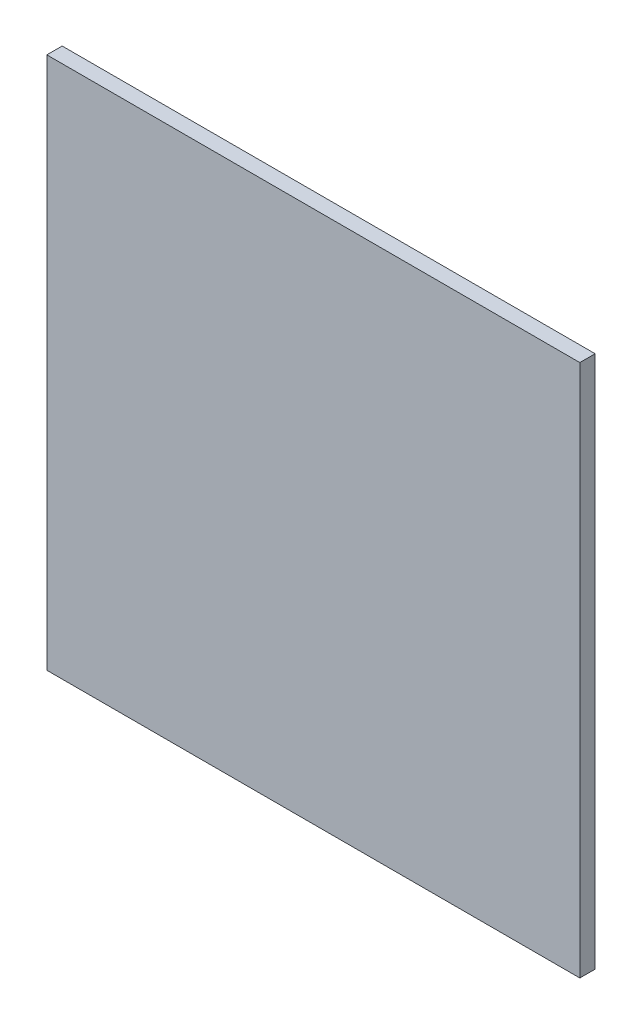
ISO-10303-21;
HEADER;
FILE_DESCRIPTION(('STEP AP214'),'2;1');
FILE_NAME('part.step','',(''),(''),'','','');
FILE_SCHEMA(('AUTOMOTIVE_DESIGN { 1 0 10303 214 1 1 1 1 }'));
ENDSEC;
DATA;
#1=APPLICATION_CONTEXT('core data for automotive mechanical design processes');
#2=APPLICATION_PROTOCOL_DEFINITION('international standard','automotive_design',2000,#1);
#3=PRODUCT_CONTEXT('',#1,'mechanical');
#4=PRODUCT('Part','Part','',(#3));
#5=PRODUCT_RELATED_PRODUCT_CATEGORY('part','',(#4));
#6=PRODUCT_DEFINITION_FORMATION('','',#4);
#7=PRODUCT_DEFINITION_CONTEXT('part definition',#1,'design');
#8=PRODUCT_DEFINITION('design','',#6,#7);
#9=PRODUCT_DEFINITION_SHAPE('','',#8);
#10=(LENGTH_UNIT() NAMED_UNIT(*) SI_UNIT(.MILLI.,.METRE.));
#11=(NAMED_UNIT(*) PLANE_ANGLE_UNIT() SI_UNIT($,.RADIAN.));
#12=(NAMED_UNIT(*) SI_UNIT($,.STERADIAN.) SOLID_ANGLE_UNIT());
#13=UNCERTAINTY_MEASURE_WITH_UNIT(LENGTH_MEASURE(1.E-05),#10,'distance_accuracy_value','');
#14=(GEOMETRIC_REPRESENTATION_CONTEXT(3) GLOBAL_UNCERTAINTY_ASSIGNED_CONTEXT((#13)) GLOBAL_UNIT_ASSIGNED_CONTEXT((#10,
#11,#12)) REPRESENTATION_CONTEXT('',''));
#15=CARTESIAN_POINT('',(0.,0.,0.));
#16=DIRECTION('',(0.,0.,1.));
#17=DIRECTION('',(1.,0.,0.));
#18=AXIS2_PLACEMENT_3D('',#15,#16,#17);
#19=CARTESIAN_POINT('',(-90.9990688728396,-374.40568115643,4.6));
#20=DIRECTION('',(1.,0.,0.));
#21=DIRECTION('',(0.,0.,-1.));
#22=AXIS2_PLACEMENT_3D('',#19,#20,#21);
#23=PLANE('',#22);
#24=DIRECTION('',(0.,-1.,0.));
#25=VECTOR('',#24,1.);
#26=CARTESIAN_POINT('',(-90.9990688728396,-374.40568115643,0.));
#27=LINE('',#26,#25);
#28=CARTESIAN_POINT('',(-90.9990688728396,-214.40568115643,0.));
#29=VERTEX_POINT('',#28);
#30=CARTESIAN_POINT('',(-90.9990688728396,-374.40568115643,0.));
#31=VERTEX_POINT('',#30);
#32=EDGE_CURVE('E96',#29,#31,#27,.T.);
#33=ORIENTED_EDGE('',*,*,#32,.T.);
#34=DIRECTION('',(0.,0.,-1.));
#35=VECTOR('',#34,1.);
#36=CARTESIAN_POINT('',(-90.9990688728396,-374.40568115643,4.6));
#37=LINE('',#36,#35);
#38=CARTESIAN_POINT('',(-90.9990688728396,-374.40568115643,4.6));
#39=VERTEX_POINT('',#38);
#40=EDGE_CURVE('E11',#39,#31,#37,.T.);
#41=ORIENTED_EDGE('',*,*,#40,.F.);
#42=DIRECTION('',(0.,-1.,0.));
#43=VECTOR('',#42,1.);
#44=CARTESIAN_POINT('',(-90.9990688728396,-374.40568115643,4.6));
#45=LINE('',#44,#43);
#46=CARTESIAN_POINT('',(-90.9990688728396,-214.40568115643,4.6));
#47=VERTEX_POINT('',#46);
#48=EDGE_CURVE('E84',#47,#39,#45,.T.);
#49=ORIENTED_EDGE('',*,*,#48,.F.);
#50=DIRECTION('',(0.,0.,-1.));
#51=VECTOR('',#50,1.);
#52=CARTESIAN_POINT('',(-90.9990688728396,-214.40568115643,4.6));
#53=LINE('',#52,#51);
#54=EDGE_CURVE('E92',#47,#29,#53,.T.);
#55=ORIENTED_EDGE('',*,*,#54,.T.);
#56=EDGE_LOOP('',(#33,#41,#49,#55));
#57=FACE_BOUND('',#56,.T.);
#58=ADVANCED_FACE('F33',(#57),#23,.F.);
#59=CARTESIAN_POINT('',(-90.9990688728396,-374.40568115643,4.6));
#60=DIRECTION('',(0.,1.,0.));
#61=DIRECTION('',(0.,0.,1.));
#62=AXIS2_PLACEMENT_3D('',#59,#60,#61);
#63=PLANE('',#62);
#64=DIRECTION('',(1.,0.,0.));
#65=VECTOR('',#64,1.);
#66=CARTESIAN_POINT('',(-90.9990688728396,-374.40568115643,0.));
#67=LINE('',#66,#65);
#68=CARTESIAN_POINT('',(69.0009311271604,-374.40568115643,0.));
#69=VERTEX_POINT('',#68);
#70=EDGE_CURVE('E88',#31,#69,#67,.T.);
#71=ORIENTED_EDGE('',*,*,#70,.T.);
#72=DIRECTION('',(0.,0.,-1.));
#73=VECTOR('',#72,1.);
#74=CARTESIAN_POINT('',(69.0009311271604,-374.40568115643,4.6));
#75=LINE('',#74,#73);
#76=CARTESIAN_POINT('',(69.0009311271604,-374.40568115643,4.6));
#77=VERTEX_POINT('',#76);
#78=EDGE_CURVE('E41',#77,#69,#75,.T.);
#79=ORIENTED_EDGE('',*,*,#78,.F.);
#80=DIRECTION('',(1.,0.,0.));
#81=VECTOR('',#80,1.);
#82=CARTESIAN_POINT('',(-90.9990688728396,-374.40568115643,4.6));
#83=LINE('',#82,#81);
#84=EDGE_CURVE('E79',#39,#77,#83,.T.);
#85=ORIENTED_EDGE('',*,*,#84,.F.);
#86=ORIENTED_EDGE('',*,*,#40,.T.);
#87=EDGE_LOOP('',(#71,#79,#85,#86));
#88=FACE_BOUND('',#87,.T.);
#89=ADVANCED_FACE('F87',(#88),#63,.F.);
#90=CARTESIAN_POINT('',(69.0009311271604,-374.40568115643,4.6));
#91=DIRECTION('',(-1.,0.,0.));
#92=DIRECTION('',(0.,0.,1.));
#93=AXIS2_PLACEMENT_3D('',#90,#91,#92);
#94=PLANE('',#93);
#95=DIRECTION('',(0.,1.,0.));
#96=VECTOR('',#95,1.);
#97=CARTESIAN_POINT('',(69.0009311271604,-374.40568115643,0.));
#98=LINE('',#97,#96);
#99=CARTESIAN_POINT('',(69.0009311271604,-214.40568115643,0.));
#100=VERTEX_POINT('',#99);
#101=EDGE_CURVE('E66',#69,#100,#98,.T.);
#102=ORIENTED_EDGE('',*,*,#101,.T.);
#103=DIRECTION('',(0.,0.,-1.));
#104=VECTOR('',#103,1.);
#105=CARTESIAN_POINT('',(69.0009311271604,-214.40568115643,4.6));
#106=LINE('',#105,#104);
#107=CARTESIAN_POINT('',(69.0009311271604,-214.40568115643,4.6));
#108=VERTEX_POINT('',#107);
#109=EDGE_CURVE('E89',#108,#100,#106,.T.);
#110=ORIENTED_EDGE('',*,*,#109,.F.);
#111=DIRECTION('',(0.,1.,0.));
#112=VECTOR('',#111,1.);
#113=CARTESIAN_POINT('',(69.0009311271604,-374.40568115643,4.6));
#114=LINE('',#113,#112);
#115=EDGE_CURVE('E82',#77,#108,#114,.T.);
#116=ORIENTED_EDGE('',*,*,#115,.F.);
#117=ORIENTED_EDGE('',*,*,#78,.T.);
#118=EDGE_LOOP('',(#102,#110,#116,#117));
#119=FACE_BOUND('',#118,.T.);
#120=ADVANCED_FACE('F90',(#119),#94,.F.);
#121=CARTESIAN_POINT('',(-90.9990688728396,-214.40568115643,4.6));
#122=DIRECTION('',(0.,-1.,0.));
#123=DIRECTION('',(0.,0.,-1.));
#124=AXIS2_PLACEMENT_3D('',#121,#122,#123);
#125=PLANE('',#124);
#126=DIRECTION('',(-1.,0.,0.));
#127=VECTOR('',#126,1.);
#128=CARTESIAN_POINT('',(-90.9990688728396,-214.40568115643,0.));
#129=LINE('',#128,#127);
#130=EDGE_CURVE('E72',#100,#29,#129,.T.);
#131=ORIENTED_EDGE('',*,*,#130,.T.);
#132=ORIENTED_EDGE('',*,*,#54,.F.);
#133=DIRECTION('',(-1.,0.,0.));
#134=VECTOR('',#133,1.);
#135=CARTESIAN_POINT('',(-90.9990688728396,-214.40568115643,4.6));
#136=LINE('',#135,#134);
#137=EDGE_CURVE('E49',#108,#47,#136,.T.);
#138=ORIENTED_EDGE('',*,*,#137,.F.);
#139=ORIENTED_EDGE('',*,*,#109,.T.);
#140=EDGE_LOOP('',(#131,#132,#138,#139));
#141=FACE_BOUND('',#140,.T.);
#142=ADVANCED_FACE('F103',(#141),#125,.F.);
#143=CARTESIAN_POINT('',(0.,0.,4.6));
#144=DIRECTION('',(0.,0.,-1.));
#145=DIRECTION('',(-1.,0.,0.));
#146=AXIS2_PLACEMENT_3D('',#143,#144,#145);
#147=PLANE('',#146);
#148=ORIENTED_EDGE('',*,*,#48,.T.);
#149=ORIENTED_EDGE('',*,*,#84,.T.);
#150=ORIENTED_EDGE('',*,*,#115,.T.);
#151=ORIENTED_EDGE('',*,*,#137,.T.);
#152=EDGE_LOOP('',(#148,#149,#150,#151));
#153=FACE_BOUND('',#152,.T.);
#154=ADVANCED_FACE('F80',(#153),#147,.F.);
#155=CARTESIAN_POINT('',(0.,0.,0.));
#156=DIRECTION('',(0.,0.,-1.));
#157=DIRECTION('',(-1.,0.,0.));
#158=AXIS2_PLACEMENT_3D('',#155,#156,#157);
#159=PLANE('',#158);
#160=ORIENTED_EDGE('',*,*,#32,.F.);
#161=ORIENTED_EDGE('',*,*,#130,.F.);
#162=ORIENTED_EDGE('',*,*,#101,.F.);
#163=ORIENTED_EDGE('',*,*,#70,.F.);
#164=EDGE_LOOP('',(#160,#161,#162,#163));
#165=FACE_BOUND('',#164,.T.);
#166=ADVANCED_FACE('F106',(#165),#159,.T.);
#167=CLOSED_SHELL('',(#58,#89,#120,#142,#154,#166));
#168=MANIFOLD_SOLID_BREP('B2',#167);
#169=ADVANCED_BREP_SHAPE_REPRESENTATION('',(#18,#168),#14);
#170=SHAPE_DEFINITION_REPRESENTATION(#9,#169);
ENDSEC;
END-ISO-10303-21;
